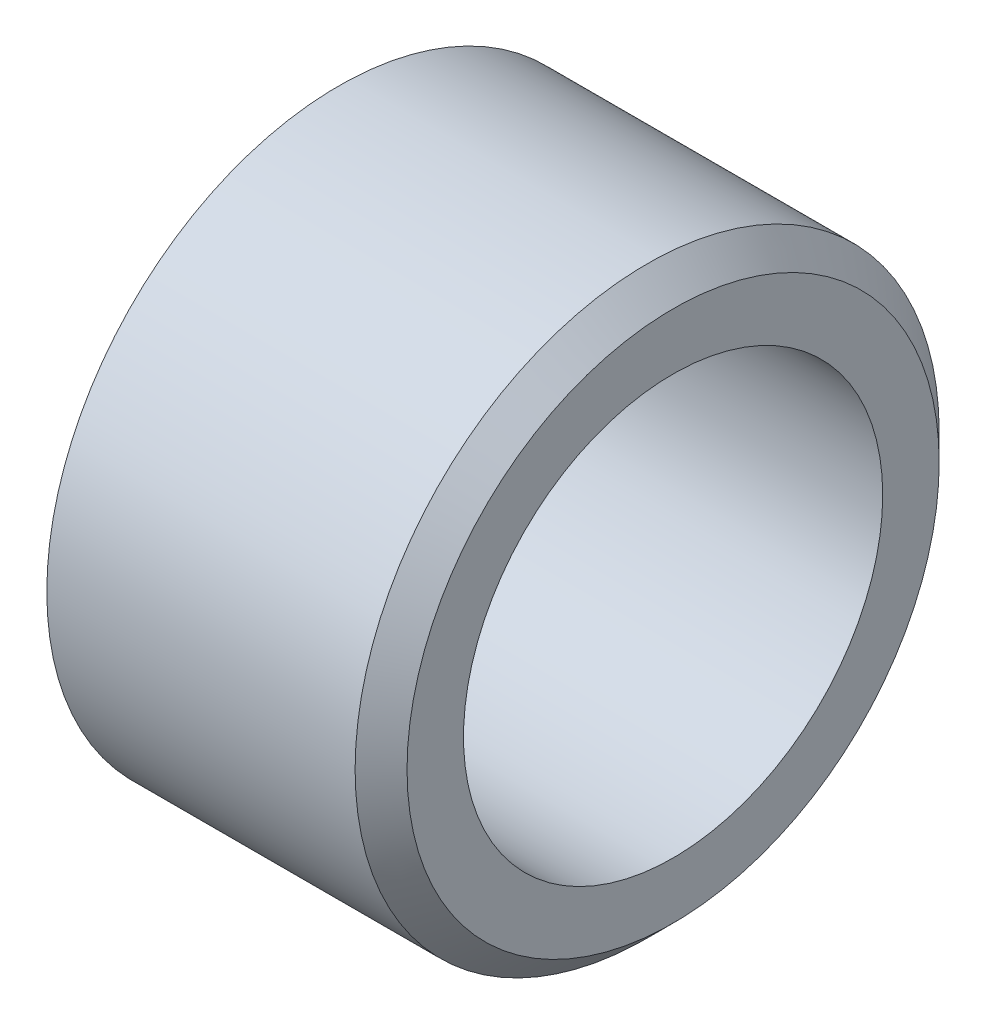
ISO-10303-21;
HEADER;
FILE_DESCRIPTION(('STEP AP214'),'2;1');
FILE_NAME('part.step','',(''),(''),'','','');
FILE_SCHEMA(('AUTOMOTIVE_DESIGN { 1 0 10303 214 1 1 1 1 }'));
ENDSEC;
DATA;
#1=APPLICATION_CONTEXT('core data for automotive mechanical design processes');
#2=APPLICATION_PROTOCOL_DEFINITION('international standard','automotive_design',2000,#1);
#3=PRODUCT_CONTEXT('',#1,'mechanical');
#4=PRODUCT('Part','Part','',(#3));
#5=PRODUCT_RELATED_PRODUCT_CATEGORY('part','',(#4));
#6=PRODUCT_DEFINITION_FORMATION('','',#4);
#7=PRODUCT_DEFINITION_CONTEXT('part definition',#1,'design');
#8=PRODUCT_DEFINITION('design','',#6,#7);
#9=PRODUCT_DEFINITION_SHAPE('','',#8);
#10=(LENGTH_UNIT() NAMED_UNIT(*) SI_UNIT(.MILLI.,.METRE.));
#11=(NAMED_UNIT(*) PLANE_ANGLE_UNIT() SI_UNIT($,.RADIAN.));
#12=(NAMED_UNIT(*) SI_UNIT($,.STERADIAN.) SOLID_ANGLE_UNIT());
#13=UNCERTAINTY_MEASURE_WITH_UNIT(LENGTH_MEASURE(1.E-05),#10,'distance_accuracy_value','');
#14=(GEOMETRIC_REPRESENTATION_CONTEXT(3) GLOBAL_UNCERTAINTY_ASSIGNED_CONTEXT((#13)) GLOBAL_UNIT_ASSIGNED_CONTEXT((#10,
#11,#12)) REPRESENTATION_CONTEXT('',''));
#15=CARTESIAN_POINT('',(0.,0.,0.));
#16=DIRECTION('',(0.,0.,1.));
#17=DIRECTION('',(1.,0.,0.));
#18=AXIS2_PLACEMENT_3D('',#15,#16,#17);
#19=CARTESIAN_POINT('',(-10.541,219.633662307834,542.12627745387));
#20=DIRECTION('',(1.,0.,0.));
#21=DIRECTION('',(0.,0.,-1.));
#22=AXIS2_PLACEMENT_3D('',#19,#20,#21);
#23=PLANE('',#22);
#24=CARTESIAN_POINT('',(-10.541,219.633662307834,542.12627745387));
#25=DIRECTION('',(1.,0.,0.));
#26=DIRECTION('',(0.,0.,-1.));
#27=AXIS2_PLACEMENT_3D('',#24,#25,#26);
#28=CIRCLE('',#27,4.1021);
#29=CARTESIAN_POINT('',(-10.541,219.633662307834,538.02417745387));
#30=VERTEX_POINT('',#29);
#31=EDGE_CURVE('E48',#30,#30,#28,.T.);
#32=ORIENTED_EDGE('',*,*,#31,.T.);
#33=EDGE_LOOP('',(#32));
#34=FACE_BOUND('',#33,.T.);
#35=CARTESIAN_POINT('',(-10.541,219.633662307834,542.12627745387));
#36=DIRECTION('',(-1.,0.,0.));
#37=DIRECTION('',(0.,0.,1.));
#38=AXIS2_PLACEMENT_3D('',#35,#36,#37);
#39=CIRCLE('',#38,5.71500000000003);
#40=CARTESIAN_POINT('',(-10.541,219.633662307834,547.84127745387));
#41=VERTEX_POINT('',#40);
#42=EDGE_CURVE('E44',#41,#41,#39,.T.);
#43=ORIENTED_EDGE('',*,*,#42,.T.);
#44=EDGE_LOOP('',(#43));
#45=FACE_BOUND('',#44,.T.);
#46=ADVANCED_FACE('F34',(#34,#45),#23,.F.);
#47=CARTESIAN_POINT('',(-4.00000000003175,219.633662307834,542.12627745387));
#48=DIRECTION('',(-1.,0.,0.));
#49=DIRECTION('',(0.,0.,1.));
#50=AXIS2_PLACEMENT_3D('',#47,#48,#49);
#51=PLANE('',#50);
#52=CARTESIAN_POINT('',(-4.00000000003175,219.633662307834,542.12627745387));
#53=DIRECTION('',(1.,0.,0.));
#54=DIRECTION('',(0.,0.,-1.));
#55=AXIS2_PLACEMENT_3D('',#52,#53,#54);
#56=CIRCLE('',#55,4.1021);
#57=CARTESIAN_POINT('',(-4.00000000003175,219.633662307834,538.02417745387));
#58=VERTEX_POINT('',#57);
#59=EDGE_CURVE('E53',#58,#58,#56,.T.);
#60=ORIENTED_EDGE('',*,*,#59,.F.);
#61=EDGE_LOOP('',(#60));
#62=FACE_BOUND('',#61,.T.);
#63=CARTESIAN_POINT('',(-4.00000000003175,219.633662307834,542.12627745387));
#64=DIRECTION('',(-1.,0.,0.));
#65=DIRECTION('',(0.,0.,1.));
#66=AXIS2_PLACEMENT_3D('',#63,#64,#65);
#67=CIRCLE('',#66,5.20699999999996);
#68=CARTESIAN_POINT('',(-4.00000000003175,219.633662307834,547.33327745387));
#69=VERTEX_POINT('',#68);
#70=EDGE_CURVE('E10',#69,#69,#67,.T.);
#71=ORIENTED_EDGE('',*,*,#70,.F.);
#72=EDGE_LOOP('',(#71));
#73=FACE_BOUND('',#72,.T.);
#74=ADVANCED_FACE('F59',(#62,#73),#51,.F.);
#75=CARTESIAN_POINT('',(-4.00000000003175,219.633662307834,542.12627745387));
#76=DIRECTION('',(-1.,0.,0.));
#77=DIRECTION('',(0.,0.,1.));
#78=AXIS2_PLACEMENT_3D('',#75,#76,#77);
#79=CONICAL_SURFACE('',#78,5.20699999999996,0.78539816339745);
#80=CARTESIAN_POINT('',(-4.50800000003181,219.633662307834,542.12627745387));
#81=DIRECTION('',(-1.,0.,0.));
#82=DIRECTION('',(0.,0.,1.));
#83=AXIS2_PLACEMENT_3D('',#80,#81,#82);
#84=CIRCLE('',#83,5.71500000000003);
#85=CARTESIAN_POINT('',(-4.50800000003181,219.633662307834,547.84127745387));
#86=VERTEX_POINT('',#85);
#87=EDGE_CURVE('E40',#86,#86,#84,.T.);
#88=ORIENTED_EDGE('',*,*,#87,.F.);
#89=EDGE_LOOP('',(#88));
#90=FACE_BOUND('',#89,.T.);
#91=ORIENTED_EDGE('',*,*,#70,.T.);
#92=EDGE_LOOP('',(#91));
#93=FACE_BOUND('',#92,.T.);
#94=ADVANCED_FACE('F62',(#90,#93),#79,.T.);
#95=CARTESIAN_POINT('',(-10.541,219.633662307834,542.12627745387));
#96=DIRECTION('',(-1.,0.,0.));
#97=DIRECTION('',(0.,0.,1.));
#98=AXIS2_PLACEMENT_3D('',#95,#96,#97);
#99=CYLINDRICAL_SURFACE('',#98,5.71500000000003);
#100=ORIENTED_EDGE('',*,*,#42,.F.);
#101=EDGE_LOOP('',(#100));
#102=FACE_BOUND('',#101,.T.);
#103=ORIENTED_EDGE('',*,*,#87,.T.);
#104=EDGE_LOOP('',(#103));
#105=FACE_BOUND('',#104,.T.);
#106=ADVANCED_FACE('F67',(#102,#105),#99,.T.);
#107=CARTESIAN_POINT('',(-4.00000000003175,219.633662307834,542.12627745387));
#108=DIRECTION('',(1.,0.,0.));
#109=DIRECTION('',(0.,0.,-1.));
#110=AXIS2_PLACEMENT_3D('',#107,#108,#109);
#111=CYLINDRICAL_SURFACE('',#110,4.1021);
#112=ORIENTED_EDGE('',*,*,#31,.F.);
#113=EDGE_LOOP('',(#112));
#114=FACE_BOUND('',#113,.T.);
#115=ORIENTED_EDGE('',*,*,#59,.T.);
#116=EDGE_LOOP('',(#115));
#117=FACE_BOUND('',#116,.T.);
#118=ADVANCED_FACE('F57',(#114,#117),#111,.F.);
#119=CLOSED_SHELL('',(#46,#74,#94,#106,#118));
#120=MANIFOLD_SOLID_BREP('B2',#119);
#121=ADVANCED_BREP_SHAPE_REPRESENTATION('',(#18,#120),#14);
#122=SHAPE_DEFINITION_REPRESENTATION(#9,#121);
ENDSEC;
END-ISO-10303-21;
